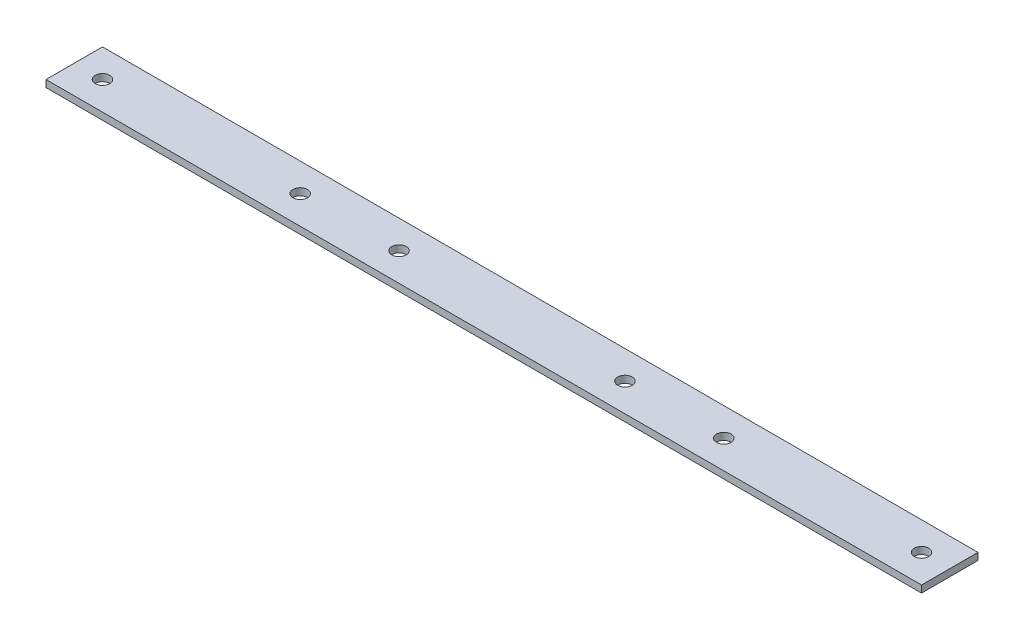
ISO-10303-21;
HEADER;
FILE_DESCRIPTION(('STEP AP214'),'2;1');
FILE_NAME('part.step','',(''),(''),'','','');
FILE_SCHEMA(('AUTOMOTIVE_DESIGN { 1 0 10303 214 1 1 1 1 }'));
ENDSEC;
DATA;
#1=APPLICATION_CONTEXT('core data for automotive mechanical design processes');
#2=APPLICATION_PROTOCOL_DEFINITION('international standard','automotive_design',2000,#1);
#3=PRODUCT_CONTEXT('',#1,'mechanical');
#4=PRODUCT('Part','Part','',(#3));
#5=PRODUCT_RELATED_PRODUCT_CATEGORY('part','',(#4));
#6=PRODUCT_DEFINITION_FORMATION('','',#4);
#7=PRODUCT_DEFINITION_CONTEXT('part definition',#1,'design');
#8=PRODUCT_DEFINITION('design','',#6,#7);
#9=PRODUCT_DEFINITION_SHAPE('','',#8);
#10=(LENGTH_UNIT() NAMED_UNIT(*) SI_UNIT(.MILLI.,.METRE.));
#11=(NAMED_UNIT(*) PLANE_ANGLE_UNIT() SI_UNIT($,.RADIAN.));
#12=(NAMED_UNIT(*) SI_UNIT($,.STERADIAN.) SOLID_ANGLE_UNIT());
#13=UNCERTAINTY_MEASURE_WITH_UNIT(LENGTH_MEASURE(1.E-05),#10,'distance_accuracy_value','');
#14=(GEOMETRIC_REPRESENTATION_CONTEXT(3) GLOBAL_UNCERTAINTY_ASSIGNED_CONTEXT((#13)) GLOBAL_UNIT_ASSIGNED_CONTEXT((#10,
#11,#12)) REPRESENTATION_CONTEXT('',''));
#15=CARTESIAN_POINT('',(0.,0.,0.));
#16=DIRECTION('',(0.,0.,1.));
#17=DIRECTION('',(1.,0.,0.));
#18=AXIS2_PLACEMENT_3D('',#15,#16,#17);
#19=CARTESIAN_POINT('',(196.85,1.5875,12.7));
#20=DIRECTION('',(-1.,0.,0.));
#21=DIRECTION('',(0.,0.,1.));
#22=AXIS2_PLACEMENT_3D('',#19,#20,#21);
#23=PLANE('',#22);
#24=DIRECTION('',(0.,0.,-1.));
#25=VECTOR('',#24,1.);
#26=CARTESIAN_POINT('',(196.85,-1.5875,12.7));
#27=LINE('',#26,#25);
#28=CARTESIAN_POINT('',(196.85,-1.5875,12.7));
#29=VERTEX_POINT('',#28);
#30=CARTESIAN_POINT('',(196.85,-1.5875,-12.7));
#31=VERTEX_POINT('',#30);
#32=EDGE_CURVE('E111',#29,#31,#27,.T.);
#33=ORIENTED_EDGE('',*,*,#32,.T.);
#34=DIRECTION('',(0.,-1.,0.));
#35=VECTOR('',#34,1.);
#36=CARTESIAN_POINT('',(196.85,1.5875,-12.7));
#37=LINE('',#36,#35);
#38=CARTESIAN_POINT('',(196.85,1.5875,-12.7));
#39=VERTEX_POINT('',#38);
#40=EDGE_CURVE('E11',#39,#31,#37,.T.);
#41=ORIENTED_EDGE('',*,*,#40,.F.);
#42=DIRECTION('',(0.,0.,-1.));
#43=VECTOR('',#42,1.);
#44=CARTESIAN_POINT('',(196.85,1.5875,12.7));
#45=LINE('',#44,#43);
#46=CARTESIAN_POINT('',(196.85,1.5875,12.7));
#47=VERTEX_POINT('',#46);
#48=EDGE_CURVE('E95',#47,#39,#45,.T.);
#49=ORIENTED_EDGE('',*,*,#48,.F.);
#50=DIRECTION('',(0.,-1.,0.));
#51=VECTOR('',#50,1.);
#52=CARTESIAN_POINT('',(196.85,1.5875,12.7));
#53=LINE('',#52,#51);
#54=EDGE_CURVE('E107',#47,#29,#53,.T.);
#55=ORIENTED_EDGE('',*,*,#54,.T.);
#56=EDGE_LOOP('',(#33,#41,#49,#55));
#57=FACE_BOUND('',#56,.T.);
#58=ADVANCED_FACE('F43',(#57),#23,.F.);
#59=CARTESIAN_POINT('',(-196.85,1.5875,-12.7));
#60=DIRECTION('',(0.,0.,1.));
#61=DIRECTION('',(1.,0.,0.));
#62=AXIS2_PLACEMENT_3D('',#59,#60,#61);
#63=PLANE('',#62);
#64=DIRECTION('',(-1.,0.,0.));
#65=VECTOR('',#64,1.);
#66=CARTESIAN_POINT('',(-196.85,-1.5875,-12.7));
#67=LINE('',#66,#65);
#68=CARTESIAN_POINT('',(-196.85,-1.5875,-12.7));
#69=VERTEX_POINT('',#68);
#70=EDGE_CURVE('E100',#31,#69,#67,.T.);
#71=ORIENTED_EDGE('',*,*,#70,.T.);
#72=DIRECTION('',(0.,-1.,0.));
#73=VECTOR('',#72,1.);
#74=CARTESIAN_POINT('',(-196.85,1.5875,-12.7));
#75=LINE('',#74,#73);
#76=CARTESIAN_POINT('',(-196.85,1.5875,-12.7));
#77=VERTEX_POINT('',#76);
#78=EDGE_CURVE('E52',#77,#69,#75,.T.);
#79=ORIENTED_EDGE('',*,*,#78,.F.);
#80=DIRECTION('',(-1.,0.,0.));
#81=VECTOR('',#80,1.);
#82=CARTESIAN_POINT('',(-196.85,1.5875,-12.7));
#83=LINE('',#82,#81);
#84=EDGE_CURVE('E90',#39,#77,#83,.T.);
#85=ORIENTED_EDGE('',*,*,#84,.F.);
#86=ORIENTED_EDGE('',*,*,#40,.T.);
#87=EDGE_LOOP('',(#71,#79,#85,#86));
#88=FACE_BOUND('',#87,.T.);
#89=ADVANCED_FACE('F99',(#88),#63,.F.);
#90=CARTESIAN_POINT('',(-196.85,1.5875,12.7));
#91=DIRECTION('',(1.,0.,0.));
#92=DIRECTION('',(0.,0.,-1.));
#93=AXIS2_PLACEMENT_3D('',#90,#91,#92);
#94=PLANE('',#93);
#95=DIRECTION('',(0.,0.,1.));
#96=VECTOR('',#95,1.);
#97=CARTESIAN_POINT('',(-196.85,-1.5875,12.7));
#98=LINE('',#97,#96);
#99=CARTESIAN_POINT('',(-196.85,-1.5875,12.7));
#100=VERTEX_POINT('',#99);
#101=EDGE_CURVE('E77',#69,#100,#98,.T.);
#102=ORIENTED_EDGE('',*,*,#101,.T.);
#103=DIRECTION('',(0.,-1.,0.));
#104=VECTOR('',#103,1.);
#105=CARTESIAN_POINT('',(-196.85,1.5875,12.7));
#106=LINE('',#105,#104);
#107=CARTESIAN_POINT('',(-196.85,1.5875,12.7));
#108=VERTEX_POINT('',#107);
#109=EDGE_CURVE('E102',#108,#100,#106,.T.);
#110=ORIENTED_EDGE('',*,*,#109,.F.);
#111=DIRECTION('',(0.,0.,1.));
#112=VECTOR('',#111,1.);
#113=CARTESIAN_POINT('',(-196.85,1.5875,12.7));
#114=LINE('',#113,#112);
#115=EDGE_CURVE('E93',#77,#108,#114,.T.);
#116=ORIENTED_EDGE('',*,*,#115,.F.);
#117=ORIENTED_EDGE('',*,*,#78,.T.);
#118=EDGE_LOOP('',(#102,#110,#116,#117));
#119=FACE_BOUND('',#118,.T.);
#120=ADVANCED_FACE('F103',(#119),#94,.F.);
#121=CARTESIAN_POINT('',(-196.85,1.5875,12.7));
#122=DIRECTION('',(0.,0.,-1.));
#123=DIRECTION('',(-1.,0.,0.));
#124=AXIS2_PLACEMENT_3D('',#121,#122,#123);
#125=PLANE('',#124);
#126=DIRECTION('',(1.,0.,0.));
#127=VECTOR('',#126,1.);
#128=CARTESIAN_POINT('',(-196.85,-1.5875,12.7));
#129=LINE('',#128,#127);
#130=EDGE_CURVE('E83',#100,#29,#129,.T.);
#131=ORIENTED_EDGE('',*,*,#130,.T.);
#132=ORIENTED_EDGE('',*,*,#54,.F.);
#133=DIRECTION('',(1.,0.,0.));
#134=VECTOR('',#133,1.);
#135=CARTESIAN_POINT('',(-196.85,1.5875,12.7));
#136=LINE('',#135,#134);
#137=EDGE_CURVE('E60',#108,#47,#136,.T.);
#138=ORIENTED_EDGE('',*,*,#137,.F.);
#139=ORIENTED_EDGE('',*,*,#109,.T.);
#140=EDGE_LOOP('',(#131,#132,#138,#139));
#141=FACE_BOUND('',#140,.T.);
#142=ADVANCED_FACE('F125',(#141),#125,.F.);
#143=CARTESIAN_POINT('',(0.,1.5875,0.));
#144=DIRECTION('',(0.,-1.,0.));
#145=DIRECTION('',(0.,0.,-1.));
#146=AXIS2_PLACEMENT_3D('',#143,#144,#145);
#147=PLANE('',#146);
#148=CARTESIAN_POINT('',(-184.15,1.5875,0.));
#149=DIRECTION('',(0.,1.,0.));
#150=DIRECTION('',(0.,0.,1.));
#151=AXIS2_PLACEMENT_3D('',#148,#149,#150);
#152=CIRCLE('',#151,3.26389999999998);
#153=CARTESIAN_POINT('',(-184.15,1.5875,3.26389999999998));
#154=VERTEX_POINT('',#153);
#155=EDGE_CURVE('E149',#154,#154,#152,.T.);
#156=ORIENTED_EDGE('',*,*,#155,.F.);
#157=EDGE_LOOP('',(#156));
#158=FACE_BOUND('',#157,.T.);
#159=CARTESIAN_POINT('',(50.8,1.5875,0.));
#160=DIRECTION('',(0.,1.,0.));
#161=DIRECTION('',(0.,0.,1.));
#162=AXIS2_PLACEMENT_3D('',#159,#160,#161);
#163=CIRCLE('',#162,3.2639);
#164=CARTESIAN_POINT('',(50.8,1.5875,3.2639));
#165=VERTEX_POINT('',#164);
#166=EDGE_CURVE('E155',#165,#165,#163,.T.);
#167=ORIENTED_EDGE('',*,*,#166,.F.);
#168=EDGE_LOOP('',(#167));
#169=FACE_BOUND('',#168,.T.);
#170=CARTESIAN_POINT('',(184.15,1.5875,0.));
#171=DIRECTION('',(0.,1.,0.));
#172=DIRECTION('',(0.,0.,1.));
#173=AXIS2_PLACEMENT_3D('',#170,#171,#172);
#174=CIRCLE('',#173,3.26390000000001);
#175=CARTESIAN_POINT('',(184.15,1.5875,3.26390000000001));
#176=VERTEX_POINT('',#175);
#177=EDGE_CURVE('E145',#176,#176,#174,.T.);
#178=ORIENTED_EDGE('',*,*,#177,.F.);
#179=EDGE_LOOP('',(#178));
#180=FACE_BOUND('',#179,.T.);
#181=CARTESIAN_POINT('',(-95.25,1.5875,0.));
#182=DIRECTION('',(0.,1.,0.));
#183=DIRECTION('',(0.,0.,1.));
#184=AXIS2_PLACEMENT_3D('',#181,#182,#183);
#185=CIRCLE('',#184,3.26389999999999);
#186=CARTESIAN_POINT('',(-95.25,1.5875,3.26389999999999));
#187=VERTEX_POINT('',#186);
#188=EDGE_CURVE('E136',#187,#187,#185,.T.);
#189=ORIENTED_EDGE('',*,*,#188,.F.);
#190=EDGE_LOOP('',(#189));
#191=FACE_BOUND('',#190,.T.);
#192=CARTESIAN_POINT('',(95.25,1.5875,0.));
#193=DIRECTION('',(0.,1.,0.));
#194=DIRECTION('',(0.,0.,1.));
#195=AXIS2_PLACEMENT_3D('',#192,#193,#194);
#196=CIRCLE('',#195,3.26389999999999);
#197=CARTESIAN_POINT('',(95.25,1.5875,3.26389999999999));
#198=VERTEX_POINT('',#197);
#199=EDGE_CURVE('E137',#198,#198,#196,.T.);
#200=ORIENTED_EDGE('',*,*,#199,.F.);
#201=EDGE_LOOP('',(#200));
#202=FACE_BOUND('',#201,.T.);
#203=CARTESIAN_POINT('',(-50.8,1.5875,0.));
#204=DIRECTION('',(0.,1.,0.));
#205=DIRECTION('',(0.,0.,1.));
#206=AXIS2_PLACEMENT_3D('',#203,#204,#205);
#207=CIRCLE('',#206,3.2639);
#208=CARTESIAN_POINT('',(-50.8,1.5875,3.2639));
#209=VERTEX_POINT('',#208);
#210=EDGE_CURVE('E154',#209,#209,#207,.T.);
#211=ORIENTED_EDGE('',*,*,#210,.F.);
#212=EDGE_LOOP('',(#211));
#213=FACE_BOUND('',#212,.T.);
#214=ORIENTED_EDGE('',*,*,#48,.T.);
#215=ORIENTED_EDGE('',*,*,#84,.T.);
#216=ORIENTED_EDGE('',*,*,#115,.T.);
#217=ORIENTED_EDGE('',*,*,#137,.T.);
#218=EDGE_LOOP('',(#214,#215,#216,#217));
#219=FACE_BOUND('',#218,.T.);
#220=ADVANCED_FACE('F91',(#158,#169,#180,#191,#202,#213,#219),#147,.F.);
#221=CARTESIAN_POINT('',(0.,-1.5875,0.));
#222=DIRECTION('',(0.,-1.,0.));
#223=DIRECTION('',(0.,0.,-1.));
#224=AXIS2_PLACEMENT_3D('',#221,#222,#223);
#225=PLANE('',#224);
#226=CARTESIAN_POINT('',(-184.15,-1.5875,0.));
#227=DIRECTION('',(0.,1.,0.));
#228=DIRECTION('',(0.,0.,1.));
#229=AXIS2_PLACEMENT_3D('',#226,#227,#228);
#230=CIRCLE('',#229,3.26389999999998);
#231=CARTESIAN_POINT('',(-184.15,-1.5875,3.26389999999998));
#232=VERTEX_POINT('',#231);
#233=EDGE_CURVE('E115',#232,#232,#230,.T.);
#234=ORIENTED_EDGE('',*,*,#233,.T.);
#235=EDGE_LOOP('',(#234));
#236=FACE_BOUND('',#235,.T.);
#237=CARTESIAN_POINT('',(50.8,-1.5875,0.));
#238=DIRECTION('',(0.,1.,0.));
#239=DIRECTION('',(0.,0.,1.));
#240=AXIS2_PLACEMENT_3D('',#237,#238,#239);
#241=CIRCLE('',#240,3.2639);
#242=CARTESIAN_POINT('',(50.8,-1.5875,3.2639));
#243=VERTEX_POINT('',#242);
#244=EDGE_CURVE('E166',#243,#243,#241,.T.);
#245=ORIENTED_EDGE('',*,*,#244,.T.);
#246=EDGE_LOOP('',(#245));
#247=FACE_BOUND('',#246,.T.);
#248=CARTESIAN_POINT('',(184.15,-1.5875,0.));
#249=DIRECTION('',(0.,1.,0.));
#250=DIRECTION('',(0.,0.,1.));
#251=AXIS2_PLACEMENT_3D('',#248,#249,#250);
#252=CIRCLE('',#251,3.26390000000001);
#253=CARTESIAN_POINT('',(184.15,-1.5875,3.26390000000001));
#254=VERTEX_POINT('',#253);
#255=EDGE_CURVE('E141',#254,#254,#252,.T.);
#256=ORIENTED_EDGE('',*,*,#255,.T.);
#257=EDGE_LOOP('',(#256));
#258=FACE_BOUND('',#257,.T.);
#259=CARTESIAN_POINT('',(-95.25,-1.5875,0.));
#260=DIRECTION('',(0.,1.,0.));
#261=DIRECTION('',(0.,0.,1.));
#262=AXIS2_PLACEMENT_3D('',#259,#260,#261);
#263=CIRCLE('',#262,3.26389999999999);
#264=CARTESIAN_POINT('',(-95.25,-1.5875,3.26389999999999));
#265=VERTEX_POINT('',#264);
#266=EDGE_CURVE('E132',#265,#265,#263,.T.);
#267=ORIENTED_EDGE('',*,*,#266,.T.);
#268=EDGE_LOOP('',(#267));
#269=FACE_BOUND('',#268,.T.);
#270=CARTESIAN_POINT('',(95.25,-1.5875,0.));
#271=DIRECTION('',(0.,1.,0.));
#272=DIRECTION('',(0.,0.,1.));
#273=AXIS2_PLACEMENT_3D('',#270,#271,#272);
#274=CIRCLE('',#273,3.26389999999999);
#275=CARTESIAN_POINT('',(95.25,-1.5875,3.26389999999999));
#276=VERTEX_POINT('',#275);
#277=EDGE_CURVE('E159',#276,#276,#274,.T.);
#278=ORIENTED_EDGE('',*,*,#277,.T.);
#279=EDGE_LOOP('',(#278));
#280=FACE_BOUND('',#279,.T.);
#281=CARTESIAN_POINT('',(-50.8,-1.5875,0.));
#282=DIRECTION('',(0.,1.,0.));
#283=DIRECTION('',(0.,0.,1.));
#284=AXIS2_PLACEMENT_3D('',#281,#282,#283);
#285=CIRCLE('',#284,3.2639);
#286=CARTESIAN_POINT('',(-50.8,-1.5875,3.2639));
#287=VERTEX_POINT('',#286);
#288=EDGE_CURVE('E150',#287,#287,#285,.T.);
#289=ORIENTED_EDGE('',*,*,#288,.T.);
#290=EDGE_LOOP('',(#289));
#291=FACE_BOUND('',#290,.T.);
#292=ORIENTED_EDGE('',*,*,#32,.F.);
#293=ORIENTED_EDGE('',*,*,#130,.F.);
#294=ORIENTED_EDGE('',*,*,#101,.F.);
#295=ORIENTED_EDGE('',*,*,#70,.F.);
#296=EDGE_LOOP('',(#292,#293,#294,#295));
#297=FACE_BOUND('',#296,.T.);
#298=ADVANCED_FACE('F128',(#236,#247,#258,#269,#280,#291,#297),#225,.T.);
#299=CARTESIAN_POINT('',(-50.8,-1.5875,0.));
#300=DIRECTION('',(0.,1.,0.));
#301=DIRECTION('',(0.,0.,1.));
#302=AXIS2_PLACEMENT_3D('',#299,#300,#301);
#303=CYLINDRICAL_SURFACE('',#302,3.2639);
#304=ORIENTED_EDGE('',*,*,#288,.F.);
#305=EDGE_LOOP('',(#304));
#306=FACE_BOUND('',#305,.T.);
#307=ORIENTED_EDGE('',*,*,#210,.T.);
#308=EDGE_LOOP('',(#307));
#309=FACE_BOUND('',#308,.T.);
#310=ADVANCED_FACE('F202',(#306,#309),#303,.F.);
#311=CARTESIAN_POINT('',(95.25,-1.5875,0.));
#312=DIRECTION('',(0.,1.,0.));
#313=DIRECTION('',(0.,0.,1.));
#314=AXIS2_PLACEMENT_3D('',#311,#312,#313);
#315=CYLINDRICAL_SURFACE('',#314,3.26389999999999);
#316=ORIENTED_EDGE('',*,*,#277,.F.);
#317=EDGE_LOOP('',(#316));
#318=FACE_BOUND('',#317,.T.);
#319=ORIENTED_EDGE('',*,*,#199,.T.);
#320=EDGE_LOOP('',(#319));
#321=FACE_BOUND('',#320,.T.);
#322=ADVANCED_FACE('F204',(#318,#321),#315,.F.);
#323=CARTESIAN_POINT('',(-95.25,-1.5875,0.));
#324=DIRECTION('',(0.,1.,0.));
#325=DIRECTION('',(0.,0.,1.));
#326=AXIS2_PLACEMENT_3D('',#323,#324,#325);
#327=CYLINDRICAL_SURFACE('',#326,3.26389999999999);
#328=ORIENTED_EDGE('',*,*,#266,.F.);
#329=EDGE_LOOP('',(#328));
#330=FACE_BOUND('',#329,.T.);
#331=ORIENTED_EDGE('',*,*,#188,.T.);
#332=EDGE_LOOP('',(#331));
#333=FACE_BOUND('',#332,.T.);
#334=ADVANCED_FACE('F211',(#330,#333),#327,.F.);
#335=CARTESIAN_POINT('',(184.15,-1.5875,0.));
#336=DIRECTION('',(0.,1.,0.));
#337=DIRECTION('',(0.,0.,1.));
#338=AXIS2_PLACEMENT_3D('',#335,#336,#337);
#339=CYLINDRICAL_SURFACE('',#338,3.26390000000001);
#340=ORIENTED_EDGE('',*,*,#255,.F.);
#341=EDGE_LOOP('',(#340));
#342=FACE_BOUND('',#341,.T.);
#343=ORIENTED_EDGE('',*,*,#177,.T.);
#344=EDGE_LOOP('',(#343));
#345=FACE_BOUND('',#344,.T.);
#346=ADVANCED_FACE('F229',(#342,#345),#339,.F.);
#347=CARTESIAN_POINT('',(50.8,-1.5875,0.));
#348=DIRECTION('',(0.,1.,0.));
#349=DIRECTION('',(0.,0.,1.));
#350=AXIS2_PLACEMENT_3D('',#347,#348,#349);
#351=CYLINDRICAL_SURFACE('',#350,3.2639);
#352=ORIENTED_EDGE('',*,*,#244,.F.);
#353=EDGE_LOOP('',(#352));
#354=FACE_BOUND('',#353,.T.);
#355=ORIENTED_EDGE('',*,*,#166,.T.);
#356=EDGE_LOOP('',(#355));
#357=FACE_BOUND('',#356,.T.);
#358=ADVANCED_FACE('F185',(#354,#357),#351,.F.);
#359=CARTESIAN_POINT('',(-184.15,-1.5875,0.));
#360=DIRECTION('',(0.,1.,0.));
#361=DIRECTION('',(0.,0.,1.));
#362=AXIS2_PLACEMENT_3D('',#359,#360,#361);
#363=CYLINDRICAL_SURFACE('',#362,3.26389999999998);
#364=ORIENTED_EDGE('',*,*,#233,.F.);
#365=EDGE_LOOP('',(#364));
#366=FACE_BOUND('',#365,.T.);
#367=ORIENTED_EDGE('',*,*,#155,.T.);
#368=EDGE_LOOP('',(#367));
#369=FACE_BOUND('',#368,.T.);
#370=ADVANCED_FACE('F182',(#366,#369),#363,.F.);
#371=CLOSED_SHELL('',(#58,#89,#120,#142,#220,#298,#310,#322,#334,#346,#358,#370));
#372=MANIFOLD_SOLID_BREP('B2',#371);
#373=ADVANCED_BREP_SHAPE_REPRESENTATION('',(#18,#372),#14);
#374=SHAPE_DEFINITION_REPRESENTATION(#9,#373);
ENDSEC;
END-ISO-10303-21;
